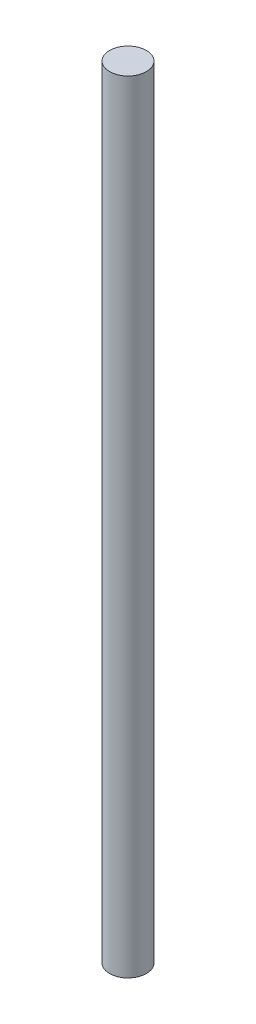
ISO-10303-21;
HEADER;
FILE_DESCRIPTION(('STEP AP214'),'2;1');
FILE_NAME('part.step','',(''),(''),'','','');
FILE_SCHEMA(('AUTOMOTIVE_DESIGN { 1 0 10303 214 1 1 1 1 }'));
ENDSEC;
DATA;
#1=APPLICATION_CONTEXT('core data for automotive mechanical design processes');
#2=APPLICATION_PROTOCOL_DEFINITION('international standard','automotive_design',2000,#1);
#3=PRODUCT_CONTEXT('',#1,'mechanical');
#4=PRODUCT('Part','Part','',(#3));
#5=PRODUCT_RELATED_PRODUCT_CATEGORY('part','',(#4));
#6=PRODUCT_DEFINITION_FORMATION('','',#4);
#7=PRODUCT_DEFINITION_CONTEXT('part definition',#1,'design');
#8=PRODUCT_DEFINITION('design','',#6,#7);
#9=PRODUCT_DEFINITION_SHAPE('','',#8);
#10=(LENGTH_UNIT() NAMED_UNIT(*) SI_UNIT(.MILLI.,.METRE.));
#11=(NAMED_UNIT(*) PLANE_ANGLE_UNIT() SI_UNIT($,.RADIAN.));
#12=(NAMED_UNIT(*) SI_UNIT($,.STERADIAN.) SOLID_ANGLE_UNIT());
#13=UNCERTAINTY_MEASURE_WITH_UNIT(LENGTH_MEASURE(1.E-05),#10,'distance_accuracy_value','');
#14=(GEOMETRIC_REPRESENTATION_CONTEXT(3) GLOBAL_UNCERTAINTY_ASSIGNED_CONTEXT((#13)) GLOBAL_UNIT_ASSIGNED_CONTEXT((#10,
#11,#12)) REPRESENTATION_CONTEXT('',''));
#15=CARTESIAN_POINT('',(0.,0.,0.));
#16=DIRECTION('',(0.,0.,1.));
#17=DIRECTION('',(1.,0.,0.));
#18=AXIS2_PLACEMENT_3D('',#15,#16,#17);
#19=CARTESIAN_POINT('',(0.,169.962442034153,0.));
#20=DIRECTION('',(0.,-1.,0.));
#21=DIRECTION('',(0.,0.,-1.));
#22=AXIS2_PLACEMENT_3D('',#19,#20,#21);
#23=CYLINDRICAL_SURFACE('',#22,4.);
#24=CARTESIAN_POINT('',(0.,169.962442034153,0.));
#25=DIRECTION('',(0.,1.,0.));
#26=DIRECTION('',(0.,0.,1.));
#27=AXIS2_PLACEMENT_3D('',#24,#25,#26);
#28=CIRCLE('',#27,4.);
#29=CARTESIAN_POINT('',(0.,169.962442034153,4.));
#30=VERTEX_POINT('',#29);
#31=EDGE_CURVE('E10',#30,#30,#28,.T.);
#32=ORIENTED_EDGE('',*,*,#31,.F.);
#33=EDGE_LOOP('',(#32));
#34=FACE_BOUND('',#33,.T.);
#35=CARTESIAN_POINT('',(0.,0.,0.));
#36=DIRECTION('',(0.,1.,0.));
#37=DIRECTION('',(0.,0.,1.));
#38=AXIS2_PLACEMENT_3D('',#35,#36,#37);
#39=CIRCLE('',#38,4.);
#40=CARTESIAN_POINT('',(0.,0.,4.));
#41=VERTEX_POINT('',#40);
#42=EDGE_CURVE('E38',#41,#41,#39,.T.);
#43=ORIENTED_EDGE('',*,*,#42,.T.);
#44=EDGE_LOOP('',(#43));
#45=FACE_BOUND('',#44,.T.);
#46=ADVANCED_FACE('F35',(#34,#45),#23,.T.);
#47=CARTESIAN_POINT('',(0.,169.962442034153,0.));
#48=DIRECTION('',(0.,1.,0.));
#49=DIRECTION('',(0.,0.,1.));
#50=AXIS2_PLACEMENT_3D('',#47,#48,#49);
#51=PLANE('',#50);
#52=ORIENTED_EDGE('',*,*,#31,.T.);
#53=EDGE_LOOP('',(#52));
#54=FACE_BOUND('',#53,.T.);
#55=ADVANCED_FACE('F50',(#54),#51,.T.);
#56=CARTESIAN_POINT('',(0.,0.,0.));
#57=DIRECTION('',(0.,1.,0.));
#58=DIRECTION('',(0.,0.,1.));
#59=AXIS2_PLACEMENT_3D('',#56,#57,#58);
#60=PLANE('',#59);
#61=ORIENTED_EDGE('',*,*,#42,.F.);
#62=EDGE_LOOP('',(#61));
#63=FACE_BOUND('',#62,.T.);
#64=ADVANCED_FACE('F48',(#63),#60,.F.);
#65=CLOSED_SHELL('',(#46,#55,#64));
#66=MANIFOLD_SOLID_BREP('B2',#65);
#67=ADVANCED_BREP_SHAPE_REPRESENTATION('',(#18,#66),#14);
#68=SHAPE_DEFINITION_REPRESENTATION(#9,#67);
ENDSEC;
END-ISO-10303-21;
